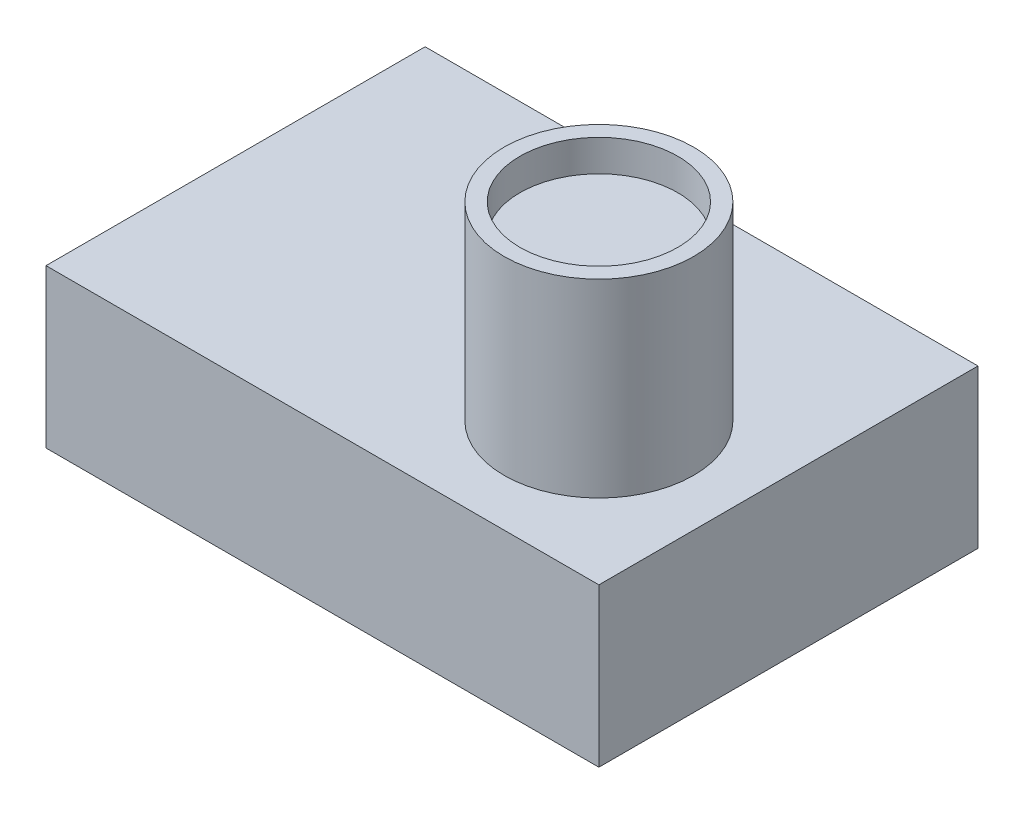
ISO-10303-21;
HEADER;
FILE_DESCRIPTION(('STEP AP214'),'2;1');
FILE_NAME('part.step','',(''),(''),'','','');
FILE_SCHEMA(('AUTOMOTIVE_DESIGN { 1 0 10303 214 1 1 1 1 }'));
ENDSEC;
DATA;
#1=APPLICATION_CONTEXT('core data for automotive mechanical design processes');
#2=APPLICATION_PROTOCOL_DEFINITION('international standard','automotive_design',2000,#1);
#3=PRODUCT_CONTEXT('',#1,'mechanical');
#4=PRODUCT('Part','Part','',(#3));
#5=PRODUCT_RELATED_PRODUCT_CATEGORY('part','',(#4));
#6=PRODUCT_DEFINITION_FORMATION('','',#4);
#7=PRODUCT_DEFINITION_CONTEXT('part definition',#1,'design');
#8=PRODUCT_DEFINITION('design','',#6,#7);
#9=PRODUCT_DEFINITION_SHAPE('','',#8);
#10=(LENGTH_UNIT() NAMED_UNIT(*) SI_UNIT(.MILLI.,.METRE.));
#11=(NAMED_UNIT(*) PLANE_ANGLE_UNIT() SI_UNIT($,.RADIAN.));
#12=(NAMED_UNIT(*) SI_UNIT($,.STERADIAN.) SOLID_ANGLE_UNIT());
#13=UNCERTAINTY_MEASURE_WITH_UNIT(LENGTH_MEASURE(1.E-05),#10,'distance_accuracy_value','');
#14=(GEOMETRIC_REPRESENTATION_CONTEXT(3) GLOBAL_UNCERTAINTY_ASSIGNED_CONTEXT((#13)) GLOBAL_UNIT_ASSIGNED_CONTEXT((#10,
#11,#12)) REPRESENTATION_CONTEXT('',''));
#15=CARTESIAN_POINT('',(0.,0.,0.));
#16=DIRECTION('',(0.,0.,1.));
#17=DIRECTION('',(1.,0.,0.));
#18=AXIS2_PLACEMENT_3D('',#15,#16,#17);
#19=CARTESIAN_POINT('',(17.5,10.,-12.));
#20=DIRECTION('',(-1.,0.,0.));
#21=DIRECTION('',(0.,0.,1.));
#22=AXIS2_PLACEMENT_3D('',#19,#20,#21);
#23=PLANE('',#22);
#24=DIRECTION('',(0.,0.,-1.));
#25=VECTOR('',#24,1.);
#26=CARTESIAN_POINT('',(17.5,0.,-12.));
#27=LINE('',#26,#25);
#28=CARTESIAN_POINT('',(17.5,0.,12.));
#29=VERTEX_POINT('',#28);
#30=CARTESIAN_POINT('',(17.5,0.,-12.));
#31=VERTEX_POINT('',#30);
#32=EDGE_CURVE('E110',#29,#31,#27,.T.);
#33=ORIENTED_EDGE('',*,*,#32,.T.);
#34=DIRECTION('',(0.,-1.,0.));
#35=VECTOR('',#34,1.);
#36=CARTESIAN_POINT('',(17.5,10.,-12.));
#37=LINE('',#36,#35);
#38=CARTESIAN_POINT('',(17.5,10.,-12.));
#39=VERTEX_POINT('',#38);
#40=EDGE_CURVE('E11',#39,#31,#37,.T.);
#41=ORIENTED_EDGE('',*,*,#40,.F.);
#42=DIRECTION('',(0.,0.,-1.));
#43=VECTOR('',#42,1.);
#44=CARTESIAN_POINT('',(17.5,10.,-12.));
#45=LINE('',#44,#43);
#46=CARTESIAN_POINT('',(17.5,10.,12.));
#47=VERTEX_POINT('',#46);
#48=EDGE_CURVE('E98',#47,#39,#45,.T.);
#49=ORIENTED_EDGE('',*,*,#48,.F.);
#50=DIRECTION('',(0.,-1.,0.));
#51=VECTOR('',#50,1.);
#52=CARTESIAN_POINT('',(17.5,10.,12.));
#53=LINE('',#52,#51);
#54=EDGE_CURVE('E106',#47,#29,#53,.T.);
#55=ORIENTED_EDGE('',*,*,#54,.T.);
#56=EDGE_LOOP('',(#33,#41,#49,#55));
#57=FACE_BOUND('',#56,.T.);
#58=ADVANCED_FACE('F47',(#57),#23,.F.);
#59=CARTESIAN_POINT('',(-17.5,10.,-12.));
#60=DIRECTION('',(0.,0.,1.));
#61=DIRECTION('',(1.,0.,0.));
#62=AXIS2_PLACEMENT_3D('',#59,#60,#61);
#63=PLANE('',#62);
#64=DIRECTION('',(-1.,0.,0.));
#65=VECTOR('',#64,1.);
#66=CARTESIAN_POINT('',(-17.5,0.,-12.));
#67=LINE('',#66,#65);
#68=CARTESIAN_POINT('',(-17.5,0.,-12.));
#69=VERTEX_POINT('',#68);
#70=EDGE_CURVE('E102',#31,#69,#67,.T.);
#71=ORIENTED_EDGE('',*,*,#70,.T.);
#72=DIRECTION('',(0.,-1.,0.));
#73=VECTOR('',#72,1.);
#74=CARTESIAN_POINT('',(-17.5,10.,-12.));
#75=LINE('',#74,#73);
#76=CARTESIAN_POINT('',(-17.5,10.,-12.));
#77=VERTEX_POINT('',#76);
#78=EDGE_CURVE('E55',#77,#69,#75,.T.);
#79=ORIENTED_EDGE('',*,*,#78,.F.);
#80=DIRECTION('',(-1.,0.,0.));
#81=VECTOR('',#80,1.);
#82=CARTESIAN_POINT('',(-17.5,10.,-12.));
#83=LINE('',#82,#81);
#84=EDGE_CURVE('E93',#39,#77,#83,.T.);
#85=ORIENTED_EDGE('',*,*,#84,.F.);
#86=ORIENTED_EDGE('',*,*,#40,.T.);
#87=EDGE_LOOP('',(#71,#79,#85,#86));
#88=FACE_BOUND('',#87,.T.);
#89=ADVANCED_FACE('F101',(#88),#63,.F.);
#90=CARTESIAN_POINT('',(-17.5,10.,-12.));
#91=DIRECTION('',(1.,0.,0.));
#92=DIRECTION('',(0.,0.,-1.));
#93=AXIS2_PLACEMENT_3D('',#90,#91,#92);
#94=PLANE('',#93);
#95=DIRECTION('',(0.,0.,1.));
#96=VECTOR('',#95,1.);
#97=CARTESIAN_POINT('',(-17.5,0.,-12.));
#98=LINE('',#97,#96);
#99=CARTESIAN_POINT('',(-17.5,0.,12.));
#100=VERTEX_POINT('',#99);
#101=EDGE_CURVE('E80',#69,#100,#98,.T.);
#102=ORIENTED_EDGE('',*,*,#101,.T.);
#103=DIRECTION('',(0.,-1.,0.));
#104=VECTOR('',#103,1.);
#105=CARTESIAN_POINT('',(-17.5,10.,12.));
#106=LINE('',#105,#104);
#107=CARTESIAN_POINT('',(-17.5,10.,12.));
#108=VERTEX_POINT('',#107);
#109=EDGE_CURVE('E103',#108,#100,#106,.T.);
#110=ORIENTED_EDGE('',*,*,#109,.F.);
#111=DIRECTION('',(0.,0.,1.));
#112=VECTOR('',#111,1.);
#113=CARTESIAN_POINT('',(-17.5,10.,-12.));
#114=LINE('',#113,#112);
#115=EDGE_CURVE('E96',#77,#108,#114,.T.);
#116=ORIENTED_EDGE('',*,*,#115,.F.);
#117=ORIENTED_EDGE('',*,*,#78,.T.);
#118=EDGE_LOOP('',(#102,#110,#116,#117));
#119=FACE_BOUND('',#118,.T.);
#120=ADVANCED_FACE('F104',(#119),#94,.F.);
#121=CARTESIAN_POINT('',(-17.5,10.,12.));
#122=DIRECTION('',(0.,0.,-1.));
#123=DIRECTION('',(-1.,0.,0.));
#124=AXIS2_PLACEMENT_3D('',#121,#122,#123);
#125=PLANE('',#124);
#126=DIRECTION('',(1.,0.,0.));
#127=VECTOR('',#126,1.);
#128=CARTESIAN_POINT('',(-17.5,0.,12.));
#129=LINE('',#128,#127);
#130=EDGE_CURVE('E86',#100,#29,#129,.T.);
#131=ORIENTED_EDGE('',*,*,#130,.T.);
#132=ORIENTED_EDGE('',*,*,#54,.F.);
#133=DIRECTION('',(1.,0.,0.));
#134=VECTOR('',#133,1.);
#135=CARTESIAN_POINT('',(-17.5,10.,12.));
#136=LINE('',#135,#134);
#137=EDGE_CURVE('E63',#108,#47,#136,.T.);
#138=ORIENTED_EDGE('',*,*,#137,.F.);
#139=ORIENTED_EDGE('',*,*,#109,.T.);
#140=EDGE_LOOP('',(#131,#132,#138,#139));
#141=FACE_BOUND('',#140,.T.);
#142=ADVANCED_FACE('F118',(#141),#125,.F.);
#143=CARTESIAN_POINT('',(0.,10.,0.));
#144=DIRECTION('',(0.,1.,0.));
#145=DIRECTION('',(0.,0.,1.));
#146=AXIS2_PLACEMENT_3D('',#143,#144,#145);
#147=PLANE('',#146);
#148=CARTESIAN_POINT('',(8.5,10.,3.));
#149=DIRECTION('',(0.,1.,0.));
#150=DIRECTION('',(0.,0.,1.));
#151=AXIS2_PLACEMENT_3D('',#148,#149,#150);
#152=CIRCLE('',#151,6.00000000000001);
#153=CARTESIAN_POINT('',(8.5,10.,9.00000000000001));
#154=VERTEX_POINT('',#153);
#155=EDGE_CURVE('E124',#154,#154,#152,.T.);
#156=ORIENTED_EDGE('',*,*,#155,.F.);
#157=EDGE_LOOP('',(#156));
#158=FACE_BOUND('',#157,.T.);
#159=ORIENTED_EDGE('',*,*,#48,.T.);
#160=ORIENTED_EDGE('',*,*,#84,.T.);
#161=ORIENTED_EDGE('',*,*,#115,.T.);
#162=ORIENTED_EDGE('',*,*,#137,.T.);
#163=EDGE_LOOP('',(#159,#160,#161,#162));
#164=FACE_BOUND('',#163,.T.);
#165=ADVANCED_FACE('F94',(#158,#164),#147,.T.);
#166=CARTESIAN_POINT('',(0.,0.,0.));
#167=DIRECTION('',(0.,1.,0.));
#168=DIRECTION('',(0.,0.,1.));
#169=AXIS2_PLACEMENT_3D('',#166,#167,#168);
#170=PLANE('',#169);
#171=ORIENTED_EDGE('',*,*,#32,.F.);
#172=ORIENTED_EDGE('',*,*,#130,.F.);
#173=ORIENTED_EDGE('',*,*,#101,.F.);
#174=ORIENTED_EDGE('',*,*,#70,.F.);
#175=EDGE_LOOP('',(#171,#172,#173,#174));
#176=FACE_BOUND('',#175,.T.);
#177=ADVANCED_FACE('F121',(#176),#170,.F.);
#178=CARTESIAN_POINT('',(8.5,22.,3.));
#179=DIRECTION('',(0.,-1.,0.));
#180=DIRECTION('',(0.,0.,-1.));
#181=AXIS2_PLACEMENT_3D('',#178,#179,#180);
#182=CYLINDRICAL_SURFACE('',#181,6.00000000000001);
#183=CARTESIAN_POINT('',(8.5,22.,3.));
#184=DIRECTION('',(0.,1.,0.));
#185=DIRECTION('',(0.,0.,1.));
#186=AXIS2_PLACEMENT_3D('',#183,#184,#185);
#187=CIRCLE('',#186,6.00000000000001);
#188=CARTESIAN_POINT('',(8.5,22.,9.00000000000001));
#189=VERTEX_POINT('',#188);
#190=EDGE_CURVE('E113',#189,#189,#187,.T.);
#191=ORIENTED_EDGE('',*,*,#190,.F.);
#192=EDGE_LOOP('',(#191));
#193=FACE_BOUND('',#192,.T.);
#194=ORIENTED_EDGE('',*,*,#155,.T.);
#195=EDGE_LOOP('',(#194));
#196=FACE_BOUND('',#195,.T.);
#197=ADVANCED_FACE('F147',(#193,#196),#182,.T.);
#198=CARTESIAN_POINT('',(8.5,22.,3.));
#199=DIRECTION('',(0.,1.,0.));
#200=DIRECTION('',(0.,0.,1.));
#201=AXIS2_PLACEMENT_3D('',#198,#199,#200);
#202=PLANE('',#201);
#203=CARTESIAN_POINT('',(8.5,22.,3.));
#204=DIRECTION('',(0.,1.,0.));
#205=DIRECTION('',(0.,0.,1.));
#206=AXIS2_PLACEMENT_3D('',#203,#204,#205);
#207=CIRCLE('',#206,5.);
#208=CARTESIAN_POINT('',(8.5,22.,8.));
#209=VERTEX_POINT('',#208);
#210=EDGE_CURVE('E130',#209,#209,#207,.T.);
#211=ORIENTED_EDGE('',*,*,#210,.F.);
#212=EDGE_LOOP('',(#211));
#213=FACE_BOUND('',#212,.T.);
#214=ORIENTED_EDGE('',*,*,#190,.T.);
#215=EDGE_LOOP('',(#214));
#216=FACE_BOUND('',#215,.T.);
#217=ADVANCED_FACE('F141',(#213,#216),#202,.T.);
#218=CARTESIAN_POINT('',(8.5,20.,3.));
#219=DIRECTION('',(0.,1.,0.));
#220=DIRECTION('',(0.,0.,1.));
#221=AXIS2_PLACEMENT_3D('',#218,#219,#220);
#222=CYLINDRICAL_SURFACE('',#221,5.);
#223=CARTESIAN_POINT('',(8.5,20.,3.));
#224=DIRECTION('',(0.,1.,0.));
#225=DIRECTION('',(0.,0.,1.));
#226=AXIS2_PLACEMENT_3D('',#223,#224,#225);
#227=CIRCLE('',#226,5.);
#228=CARTESIAN_POINT('',(8.5,20.,8.));
#229=VERTEX_POINT('',#228);
#230=EDGE_CURVE('E127',#229,#229,#227,.T.);
#231=ORIENTED_EDGE('',*,*,#230,.F.);
#232=EDGE_LOOP('',(#231));
#233=FACE_BOUND('',#232,.T.);
#234=ORIENTED_EDGE('',*,*,#210,.T.);
#235=EDGE_LOOP('',(#234));
#236=FACE_BOUND('',#235,.T.);
#237=ADVANCED_FACE('F138',(#233,#236),#222,.F.);
#238=CARTESIAN_POINT('',(8.5,20.,3.));
#239=DIRECTION('',(0.,1.,0.));
#240=DIRECTION('',(0.,0.,1.));
#241=AXIS2_PLACEMENT_3D('',#238,#239,#240);
#242=PLANE('',#241);
#243=ORIENTED_EDGE('',*,*,#230,.T.);
#244=EDGE_LOOP('',(#243));
#245=FACE_BOUND('',#244,.T.);
#246=ADVANCED_FACE('F136',(#245),#242,.T.);
#247=CLOSED_SHELL('',(#58,#89,#120,#142,#165,#177,#197,#217,#237,#246));
#248=MANIFOLD_SOLID_BREP('B2',#247);
#249=ADVANCED_BREP_SHAPE_REPRESENTATION('',(#18,#248),#14);
#250=SHAPE_DEFINITION_REPRESENTATION(#9,#249);
ENDSEC;
END-ISO-10303-21;
